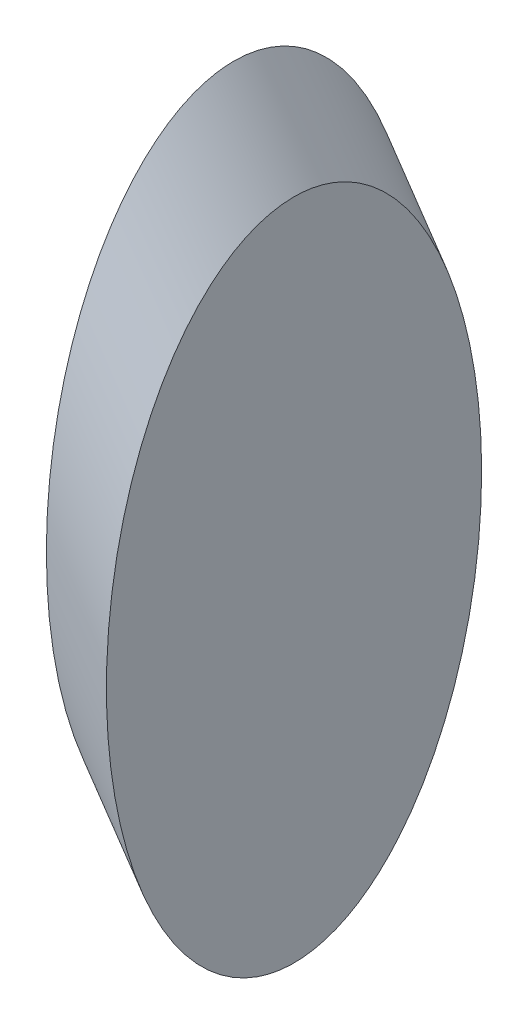
ISO-10303-21;
HEADER;
FILE_DESCRIPTION(('STEP AP214'),'2;1');
FILE_NAME('part.step','',(''),(''),'','','');
FILE_SCHEMA(('AUTOMOTIVE_DESIGN { 1 0 10303 214 1 1 1 1 }'));
ENDSEC;
DATA;
#1=APPLICATION_CONTEXT('core data for automotive mechanical design processes');
#2=APPLICATION_PROTOCOL_DEFINITION('international standard','automotive_design',2000,#1);
#3=PRODUCT_CONTEXT('',#1,'mechanical');
#4=PRODUCT('Part','Part','',(#3));
#5=PRODUCT_RELATED_PRODUCT_CATEGORY('part','',(#4));
#6=PRODUCT_DEFINITION_FORMATION('','',#4);
#7=PRODUCT_DEFINITION_CONTEXT('part definition',#1,'design');
#8=PRODUCT_DEFINITION('design','',#6,#7);
#9=PRODUCT_DEFINITION_SHAPE('','',#8);
#10=(LENGTH_UNIT() NAMED_UNIT(*) SI_UNIT(.MILLI.,.METRE.));
#11=(NAMED_UNIT(*) PLANE_ANGLE_UNIT() SI_UNIT($,.RADIAN.));
#12=(NAMED_UNIT(*) SI_UNIT($,.STERADIAN.) SOLID_ANGLE_UNIT());
#13=UNCERTAINTY_MEASURE_WITH_UNIT(LENGTH_MEASURE(1.E-05),#10,'distance_accuracy_value','');
#14=(GEOMETRIC_REPRESENTATION_CONTEXT(3) GLOBAL_UNCERTAINTY_ASSIGNED_CONTEXT((#13)) GLOBAL_UNIT_ASSIGNED_CONTEXT((#10,
#11,#12)) REPRESENTATION_CONTEXT('',''));
#15=CARTESIAN_POINT('',(0.,0.,0.));
#16=DIRECTION('',(0.,0.,1.));
#17=DIRECTION('',(1.,0.,0.));
#18=AXIS2_PLACEMENT_3D('',#15,#16,#17);
#19=CARTESIAN_POINT('',(0.999999999999997,9.59456130742765,-6.25));
#20=DIRECTION('',(1.,0.,0.));
#21=DIRECTION('',(0.,1.,0.));
#22=AXIS2_PLACEMENT_3D('',#19,#20,#21);
#23=PLANE('',#22);
#24=CARTESIAN_POINT('',(1.,-1.45864203475964,0.));
#25=DIRECTION('',(1.,0.,0.));
#26=DIRECTION('',(0.,1.,0.));
#27=AXIS2_PLACEMENT_3D('',#24,#25,#26);
#28=ELLIPSE('',#27,11.0532033421873,6.25);
#29=CARTESIAN_POINT('',(1.,9.59456130742764,0.));
#30=VERTEX_POINT('',#29);
#31=EDGE_CURVE('E18',#30,#30,#28,.F.);
#32=ORIENTED_EDGE('',*,*,#31,.F.);
#33=EDGE_LOOP('',(#32));
#34=FACE_BOUND('',#33,.T.);
#35=ADVANCED_FACE('F15',(#34),#23,.T.);
#36=CARTESIAN_POINT('',(28.272346968165,-41.2392337090748,0.));
#37=DIRECTION('',(-0.5654469393633,0.824784674181496,0.));
#38=DIRECTION('',(-0.824784674181496,-0.5654469393633,0.));
#39=AXIS2_PLACEMENT_3D('',#36,#37,#38);
#40=CYLINDRICAL_SURFACE('',#39,6.25);
#41=ORIENTED_EDGE('',*,*,#31,.T.);
#42=EDGE_LOOP('',(#41));
#43=FACE_BOUND('',#42,.T.);
#44=CARTESIAN_POINT('',(-1.,1.45864203475964,0.));
#45=DIRECTION('',(-1.,0.,0.));
#46=DIRECTION('',(0.,1.,0.));
#47=AXIS2_PLACEMENT_3D('',#44,#45,#46);
#48=ELLIPSE('',#47,11.0532033421873,6.25);
#49=CARTESIAN_POINT('',(-1.,12.5118453769469,0.));
#50=VERTEX_POINT('',#49);
#51=EDGE_CURVE('E9',#50,#50,#48,.T.);
#52=ORIENTED_EDGE('',*,*,#51,.F.);
#53=EDGE_LOOP('',(#52));
#54=FACE_BOUND('',#53,.T.);
#55=ADVANCED_FACE('F27',(#43,#54),#40,.T.);
#56=CARTESIAN_POINT('',(-0.999999999999999,12.5118453769469,-6.25));
#57=DIRECTION('',(-1.,0.,0.));
#58=DIRECTION('',(0.,0.,1.));
#59=AXIS2_PLACEMENT_3D('',#56,#57,#58);
#60=PLANE('',#59);
#61=ORIENTED_EDGE('',*,*,#51,.T.);
#62=EDGE_LOOP('',(#61));
#63=FACE_BOUND('',#62,.T.);
#64=ADVANCED_FACE('F34',(#63),#60,.T.);
#65=CLOSED_SHELL('',(#35,#55,#64));
#66=MANIFOLD_SOLID_BREP('B1',#65);
#67=ADVANCED_BREP_SHAPE_REPRESENTATION('',(#18,#66),#14);
#68=SHAPE_DEFINITION_REPRESENTATION(#9,#67);
ENDSEC;
END-ISO-10303-21;
